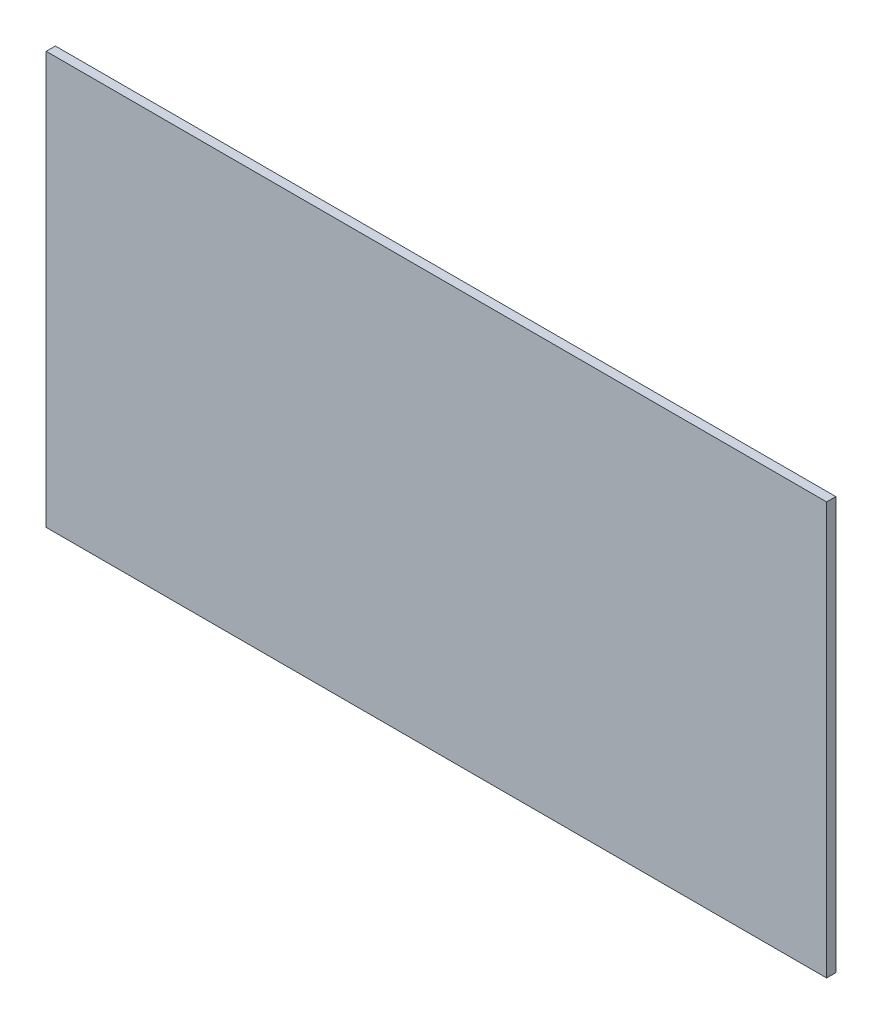
ISO-10303-21;
HEADER;
FILE_DESCRIPTION(('STEP AP214'),'2;1');
FILE_NAME('part.step','',(''),(''),'','','');
FILE_SCHEMA(('AUTOMOTIVE_DESIGN { 1 0 10303 214 1 1 1 1 }'));
ENDSEC;
DATA;
#1=APPLICATION_CONTEXT('core data for automotive mechanical design processes');
#2=APPLICATION_PROTOCOL_DEFINITION('international standard','automotive_design',2000,#1);
#3=PRODUCT_CONTEXT('',#1,'mechanical');
#4=PRODUCT('Part','Part','',(#3));
#5=PRODUCT_RELATED_PRODUCT_CATEGORY('part','',(#4));
#6=PRODUCT_DEFINITION_FORMATION('','',#4);
#7=PRODUCT_DEFINITION_CONTEXT('part definition',#1,'design');
#8=PRODUCT_DEFINITION('design','',#6,#7);
#9=PRODUCT_DEFINITION_SHAPE('','',#8);
#10=(LENGTH_UNIT() NAMED_UNIT(*) SI_UNIT(.MILLI.,.METRE.));
#11=(NAMED_UNIT(*) PLANE_ANGLE_UNIT() SI_UNIT($,.RADIAN.));
#12=(NAMED_UNIT(*) SI_UNIT($,.STERADIAN.) SOLID_ANGLE_UNIT());
#13=UNCERTAINTY_MEASURE_WITH_UNIT(LENGTH_MEASURE(1.E-05),#10,'distance_accuracy_value','');
#14=(GEOMETRIC_REPRESENTATION_CONTEXT(3) GLOBAL_UNCERTAINTY_ASSIGNED_CONTEXT((#13)) GLOBAL_UNIT_ASSIGNED_CONTEXT((#10,
#11,#12)) REPRESENTATION_CONTEXT('',''));
#15=CARTESIAN_POINT('',(0.,0.,0.));
#16=DIRECTION('',(0.,0.,1.));
#17=DIRECTION('',(1.,0.,0.));
#18=AXIS2_PLACEMENT_3D('',#15,#16,#17);
#19=CARTESIAN_POINT('',(0.,898.157210253664,20.));
#20=DIRECTION('',(1.,0.,0.));
#21=DIRECTION('',(0.,0.,-1.));
#22=AXIS2_PLACEMENT_3D('',#19,#20,#21);
#23=PLANE('',#22);
#24=DIRECTION('',(0.,-1.,0.));
#25=VECTOR('',#24,1.);
#26=CARTESIAN_POINT('',(0.,898.157210253664,0.));
#27=LINE('',#26,#25);
#28=CARTESIAN_POINT('',(0.,898.157210253664,0.));
#29=VERTEX_POINT('',#28);
#30=CARTESIAN_POINT('',(0.,0.,0.));
#31=VERTEX_POINT('',#30);
#32=EDGE_CURVE('E106',#29,#31,#27,.T.);
#33=ORIENTED_EDGE('',*,*,#32,.T.);
#34=DIRECTION('',(0.,0.,-1.));
#35=VECTOR('',#34,1.);
#36=CARTESIAN_POINT('',(0.,0.,20.));
#37=LINE('',#36,#35);
#38=CARTESIAN_POINT('',(0.,0.,20.));
#39=VERTEX_POINT('',#38);
#40=EDGE_CURVE('E11',#39,#31,#37,.T.);
#41=ORIENTED_EDGE('',*,*,#40,.F.);
#42=DIRECTION('',(0.,-1.,0.));
#43=VECTOR('',#42,1.);
#44=CARTESIAN_POINT('',(0.,898.157210253664,20.));
#45=LINE('',#44,#43);
#46=CARTESIAN_POINT('',(0.,898.157210253664,20.));
#47=VERTEX_POINT('',#46);
#48=EDGE_CURVE('E94',#47,#39,#45,.T.);
#49=ORIENTED_EDGE('',*,*,#48,.F.);
#50=DIRECTION('',(0.,0.,-1.));
#51=VECTOR('',#50,1.);
#52=CARTESIAN_POINT('',(0.,898.157210253664,20.));
#53=LINE('',#52,#51);
#54=EDGE_CURVE('E102',#47,#29,#53,.T.);
#55=ORIENTED_EDGE('',*,*,#54,.T.);
#56=EDGE_LOOP('',(#33,#41,#49,#55));
#57=FACE_BOUND('',#56,.T.);
#58=ADVANCED_FACE('F43',(#57),#23,.F.);
#59=CARTESIAN_POINT('',(0.,0.,20.));
#60=DIRECTION('',(0.,1.,0.));
#61=DIRECTION('',(0.,0.,1.));
#62=AXIS2_PLACEMENT_3D('',#59,#60,#61);
#63=PLANE('',#62);
#64=DIRECTION('',(1.,0.,0.));
#65=VECTOR('',#64,1.);
#66=CARTESIAN_POINT('',(0.,0.,0.));
#67=LINE('',#66,#65);
#68=CARTESIAN_POINT('',(1700.,0.,0.));
#69=VERTEX_POINT('',#68);
#70=EDGE_CURVE('E98',#31,#69,#67,.T.);
#71=ORIENTED_EDGE('',*,*,#70,.T.);
#72=DIRECTION('',(0.,0.,-1.));
#73=VECTOR('',#72,1.);
#74=CARTESIAN_POINT('',(1700.,0.,20.));
#75=LINE('',#74,#73);
#76=CARTESIAN_POINT('',(1700.,0.,20.));
#77=VERTEX_POINT('',#76);
#78=EDGE_CURVE('E51',#77,#69,#75,.T.);
#79=ORIENTED_EDGE('',*,*,#78,.F.);
#80=DIRECTION('',(1.,0.,0.));
#81=VECTOR('',#80,1.);
#82=CARTESIAN_POINT('',(0.,0.,20.));
#83=LINE('',#82,#81);
#84=EDGE_CURVE('E89',#39,#77,#83,.T.);
#85=ORIENTED_EDGE('',*,*,#84,.F.);
#86=ORIENTED_EDGE('',*,*,#40,.T.);
#87=EDGE_LOOP('',(#71,#79,#85,#86));
#88=FACE_BOUND('',#87,.T.);
#89=ADVANCED_FACE('F97',(#88),#63,.F.);
#90=CARTESIAN_POINT('',(1700.,0.,20.));
#91=DIRECTION('',(-1.,0.,0.));
#92=DIRECTION('',(0.,0.,1.));
#93=AXIS2_PLACEMENT_3D('',#90,#91,#92);
#94=PLANE('',#93);
#95=DIRECTION('',(0.,1.,0.));
#96=VECTOR('',#95,1.);
#97=CARTESIAN_POINT('',(1700.,0.,0.));
#98=LINE('',#97,#96);
#99=CARTESIAN_POINT('',(1700.,898.157210253664,0.));
#100=VERTEX_POINT('',#99);
#101=EDGE_CURVE('E76',#69,#100,#98,.T.);
#102=ORIENTED_EDGE('',*,*,#101,.T.);
#103=DIRECTION('',(0.,0.,-1.));
#104=VECTOR('',#103,1.);
#105=CARTESIAN_POINT('',(1700.,898.157210253664,20.));
#106=LINE('',#105,#104);
#107=CARTESIAN_POINT('',(1700.,898.157210253664,20.));
#108=VERTEX_POINT('',#107);
#109=EDGE_CURVE('E99',#108,#100,#106,.T.);
#110=ORIENTED_EDGE('',*,*,#109,.F.);
#111=DIRECTION('',(0.,1.,0.));
#112=VECTOR('',#111,1.);
#113=CARTESIAN_POINT('',(1700.,0.,20.));
#114=LINE('',#113,#112);
#115=EDGE_CURVE('E92',#77,#108,#114,.T.);
#116=ORIENTED_EDGE('',*,*,#115,.F.);
#117=ORIENTED_EDGE('',*,*,#78,.T.);
#118=EDGE_LOOP('',(#102,#110,#116,#117));
#119=FACE_BOUND('',#118,.T.);
#120=ADVANCED_FACE('F100',(#119),#94,.F.);
#121=CARTESIAN_POINT('',(1700.,898.157210253664,20.));
#122=DIRECTION('',(0.,-1.,0.));
#123=DIRECTION('',(0.,0.,-1.));
#124=AXIS2_PLACEMENT_3D('',#121,#122,#123);
#125=PLANE('',#124);
#126=DIRECTION('',(-1.,0.,0.));
#127=VECTOR('',#126,1.);
#128=CARTESIAN_POINT('',(1700.,898.157210253664,0.));
#129=LINE('',#128,#127);
#130=EDGE_CURVE('E82',#100,#29,#129,.T.);
#131=ORIENTED_EDGE('',*,*,#130,.T.);
#132=ORIENTED_EDGE('',*,*,#54,.F.);
#133=DIRECTION('',(-1.,0.,0.));
#134=VECTOR('',#133,1.);
#135=CARTESIAN_POINT('',(1700.,898.157210253664,20.));
#136=LINE('',#135,#134);
#137=EDGE_CURVE('E59',#108,#47,#136,.T.);
#138=ORIENTED_EDGE('',*,*,#137,.F.);
#139=ORIENTED_EDGE('',*,*,#109,.T.);
#140=EDGE_LOOP('',(#131,#132,#138,#139));
#141=FACE_BOUND('',#140,.T.);
#142=ADVANCED_FACE('F113',(#141),#125,.F.);
#143=CARTESIAN_POINT('',(0.,0.,20.));
#144=DIRECTION('',(0.,0.,1.));
#145=DIRECTION('',(1.,0.,0.));
#146=AXIS2_PLACEMENT_3D('',#143,#144,#145);
#147=PLANE('',#146);
#148=ORIENTED_EDGE('',*,*,#48,.T.);
#149=ORIENTED_EDGE('',*,*,#84,.T.);
#150=ORIENTED_EDGE('',*,*,#115,.T.);
#151=ORIENTED_EDGE('',*,*,#137,.T.);
#152=EDGE_LOOP('',(#148,#149,#150,#151));
#153=FACE_BOUND('',#152,.T.);
#154=ADVANCED_FACE('F90',(#153),#147,.T.);
#155=CARTESIAN_POINT('',(0.,0.,0.));
#156=DIRECTION('',(0.,0.,1.));
#157=DIRECTION('',(1.,0.,0.));
#158=AXIS2_PLACEMENT_3D('',#155,#156,#157);
#159=PLANE('',#158);
#160=ORIENTED_EDGE('',*,*,#32,.F.);
#161=ORIENTED_EDGE('',*,*,#130,.F.);
#162=ORIENTED_EDGE('',*,*,#101,.F.);
#163=ORIENTED_EDGE('',*,*,#70,.F.);
#164=EDGE_LOOP('',(#160,#161,#162,#163));
#165=FACE_BOUND('',#164,.T.);
#166=ADVANCED_FACE('F116',(#165),#159,.F.);
#167=CLOSED_SHELL('',(#58,#89,#120,#142,#154,#166));
#168=MANIFOLD_SOLID_BREP('B2',#167);
#169=ADVANCED_BREP_SHAPE_REPRESENTATION('',(#18,#168),#14);
#170=SHAPE_DEFINITION_REPRESENTATION(#9,#169);
ENDSEC;
END-ISO-10303-21;
